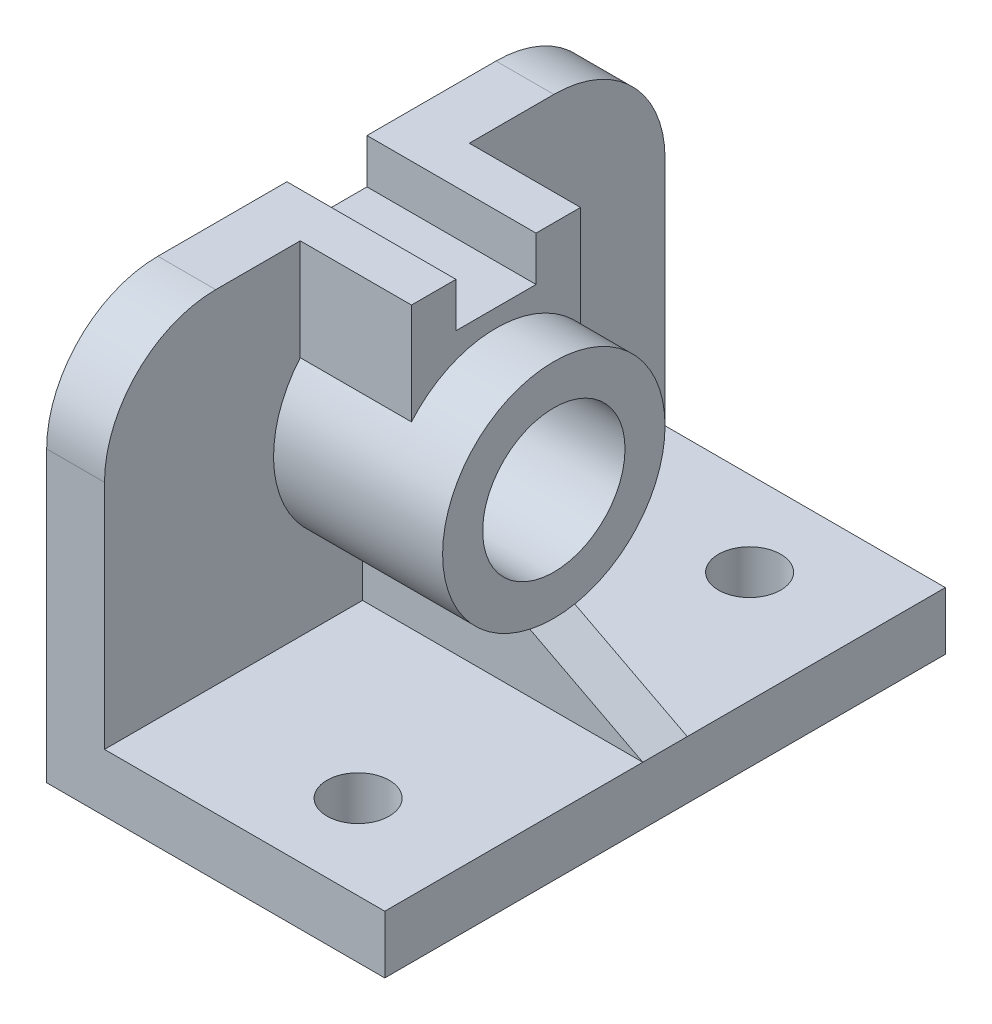
ISO-10303-21;
HEADER;
FILE_DESCRIPTION(('STEP AP214'),'2;1');
FILE_NAME('part.step','',(''),(''),'','','');
FILE_SCHEMA(('AUTOMOTIVE_DESIGN { 1 0 10303 214 1 1 1 1 }'));
ENDSEC;
DATA;
#1=APPLICATION_CONTEXT('core data for automotive mechanical design processes');
#2=APPLICATION_PROTOCOL_DEFINITION('international standard','automotive_design',2000,#1);
#3=PRODUCT_CONTEXT('',#1,'mechanical');
#4=PRODUCT('Part','Part','',(#3));
#5=PRODUCT_RELATED_PRODUCT_CATEGORY('part','',(#4));
#6=PRODUCT_DEFINITION_FORMATION('','',#4);
#7=PRODUCT_DEFINITION_CONTEXT('part definition',#1,'design');
#8=PRODUCT_DEFINITION('design','',#6,#7);
#9=PRODUCT_DEFINITION_SHAPE('','',#8);
#10=(LENGTH_UNIT() NAMED_UNIT(*) SI_UNIT(.MILLI.,.METRE.));
#11=(NAMED_UNIT(*) PLANE_ANGLE_UNIT() SI_UNIT($,.RADIAN.));
#12=(NAMED_UNIT(*) SI_UNIT($,.STERADIAN.) SOLID_ANGLE_UNIT());
#13=UNCERTAINTY_MEASURE_WITH_UNIT(LENGTH_MEASURE(1.E-05),#10,'distance_accuracy_value','');
#14=(GEOMETRIC_REPRESENTATION_CONTEXT(3) GLOBAL_UNCERTAINTY_ASSIGNED_CONTEXT((#13)) GLOBAL_UNIT_ASSIGNED_CONTEXT((#10,
#11,#12)) REPRESENTATION_CONTEXT('',''));
#15=CARTESIAN_POINT('',(0.,0.,0.));
#16=DIRECTION('',(0.,0.,1.));
#17=DIRECTION('',(1.,0.,0.));
#18=AXIS2_PLACEMENT_3D('',#15,#16,#17);
#19=CARTESIAN_POINT('',(-25.,90.,63.));
#20=DIRECTION('',(-1.,0.,0.));
#21=DIRECTION('',(0.,0.,1.));
#22=AXIS2_PLACEMENT_3D('',#19,#20,#21);
#23=PLANE('',#22);
#24=DIRECTION('',(0.,1.,0.));
#25=VECTOR('',#24,1.);
#26=CARTESIAN_POINT('',(-25.,90.,-5.));
#27=LINE('',#26,#25);
#28=CARTESIAN_POINT('',(-25.,13.,-5.));
#29=VERTEX_POINT('',#28);
#30=CARTESIAN_POINT('',(-25.,26.5051025721682,-5.));
#31=VERTEX_POINT('',#30);
#32=EDGE_CURVE('E208',#29,#31,#27,.T.);
#33=ORIENTED_EDGE('',*,*,#32,.F.);
#34=DIRECTION('',(0.,0.,-1.));
#35=VECTOR('',#34,1.);
#36=CARTESIAN_POINT('',(-25.,13.,63.));
#37=LINE('',#36,#35);
#38=CARTESIAN_POINT('',(-25.,13.,-63.));
#39=VERTEX_POINT('',#38);
#40=EDGE_CURVE('E315',#29,#39,#37,.T.);
#41=ORIENTED_EDGE('',*,*,#40,.T.);
#42=DIRECTION('',(0.,-1.,0.));
#43=VECTOR('',#42,1.);
#44=CARTESIAN_POINT('',(-25.,90.,-63.));
#45=LINE('',#44,#43);
#46=CARTESIAN_POINT('',(-25.,65.,-63.));
#47=VERTEX_POINT('',#46);
#48=EDGE_CURVE('E334',#47,#39,#45,.T.);
#49=ORIENTED_EDGE('',*,*,#48,.F.);
#50=CARTESIAN_POINT('',(-25.,65.,-38.));
#51=DIRECTION('',(-1.,0.,0.));
#52=DIRECTION('',(0.,0.,1.));
#53=AXIS2_PLACEMENT_3D('',#50,#51,#52);
#54=CIRCLE('',#53,25.);
#55=CARTESIAN_POINT('',(-25.,90.,-38.));
#56=VERTEX_POINT('',#55);
#57=EDGE_CURVE('E55',#47,#56,#54,.F.);
#58=ORIENTED_EDGE('',*,*,#57,.T.);
#59=DIRECTION('',(0.,0.,-1.));
#60=VECTOR('',#59,1.);
#61=CARTESIAN_POINT('',(-25.,90.,63.));
#62=LINE('',#61,#60);
#63=CARTESIAN_POINT('',(-25.,90.,-19.));
#64=VERTEX_POINT('',#63);
#65=EDGE_CURVE('E329',#64,#56,#62,.T.);
#66=ORIENTED_EDGE('',*,*,#65,.F.);
#67=DIRECTION('',(0.,1.,0.));
#68=VECTOR('',#67,1.);
#69=CARTESIAN_POINT('',(-25.,0.,-19.));
#70=LINE('',#69,#68);
#71=CARTESIAN_POINT('',(-25.,67.2480768092719,-19.));
#72=VERTEX_POINT('',#71);
#73=EDGE_CURVE('E248',#72,#64,#70,.T.);
#74=ORIENTED_EDGE('',*,*,#73,.F.);
#75=CARTESIAN_POINT('',(-25.,51.,0.));
#76=DIRECTION('',(1.,0.,0.));
#77=DIRECTION('',(0.,0.,-1.));
#78=AXIS2_PLACEMENT_3D('',#75,#76,#77);
#79=CIRCLE('',#78,25.);
#80=EDGE_CURVE('E240',#31,#72,#79,.T.);
#81=ORIENTED_EDGE('',*,*,#80,.F.);
#82=EDGE_LOOP('',(#33,#41,#49,#58,#66,#74,#81));
#83=FACE_BOUND('',#82,.T.);
#84=ADVANCED_FACE('F46',(#83),#23,.F.);
#85=CARTESIAN_POINT('',(0.,13.,0.));
#86=DIRECTION('',(0.,1.,0.));
#87=DIRECTION('',(0.,0.,1.));
#88=AXIS2_PLACEMENT_3D('',#85,#86,#87);
#89=PLANE('',#88);
#90=CARTESIAN_POINT('',(13.,13.,-44.));
#91=DIRECTION('',(0.,1.,0.));
#92=DIRECTION('',(0.,0.,-1.));
#93=AXIS2_PLACEMENT_3D('',#90,#91,#92);
#94=CIRCLE('',#93,7.);
#95=CARTESIAN_POINT('',(13.,13.,-37.));
#96=VERTEX_POINT('',#95);
#97=EDGE_CURVE('E549',#96,#96,#94,.T.);
#98=ORIENTED_EDGE('',*,*,#97,.F.);
#99=EDGE_LOOP('',(#98));
#100=FACE_BOUND('',#99,.T.);
#101=ORIENTED_EDGE('',*,*,#40,.F.);
#102=DIRECTION('',(1.,0.,0.));
#103=VECTOR('',#102,1.);
#104=CARTESIAN_POINT('',(0.,13.,-5.));
#105=LINE('',#104,#103);
#106=CARTESIAN_POINT('',(38.,13.,-5.));
#107=VERTEX_POINT('',#106);
#108=EDGE_CURVE('E62',#29,#107,#105,.T.);
#109=ORIENTED_EDGE('',*,*,#108,.T.);
#110=DIRECTION('',(0.,0.,-1.));
#111=VECTOR('',#110,1.);
#112=CARTESIAN_POINT('',(38.,13.,63.));
#113=LINE('',#112,#111);
#114=CARTESIAN_POINT('',(38.,13.,-63.));
#115=VERTEX_POINT('',#114);
#116=EDGE_CURVE('E350',#107,#115,#113,.T.);
#117=ORIENTED_EDGE('',*,*,#116,.T.);
#118=DIRECTION('',(-1.,0.,0.));
#119=VECTOR('',#118,1.);
#120=CARTESIAN_POINT('',(38.,13.,-63.));
#121=LINE('',#120,#119);
#122=EDGE_CURVE('E349',#115,#39,#121,.T.);
#123=ORIENTED_EDGE('',*,*,#122,.T.);
#124=EDGE_LOOP('',(#101,#109,#117,#123));
#125=FACE_BOUND('',#124,.T.);
#126=ADVANCED_FACE('F467',(#100,#125),#89,.T.);
#127=CARTESIAN_POINT('',(-25.,13.,63.));
#128=VERTEX_POINT('',#127);
#129=CARTESIAN_POINT('',(-25.,13.,5.));
#130=VERTEX_POINT('',#129);
#131=EDGE_CURVE('E335',#128,#130,#37,.T.);
#132=ORIENTED_EDGE('',*,*,#131,.T.);
#133=DIRECTION('',(0.,1.,0.));
#134=VECTOR('',#133,1.);
#135=CARTESIAN_POINT('',(-25.,90.,5.));
#136=LINE('',#135,#134);
#137=CARTESIAN_POINT('',(-25.,26.5051025721682,5.));
#138=VERTEX_POINT('',#137);
#139=EDGE_CURVE('E232',#130,#138,#136,.T.);
#140=ORIENTED_EDGE('',*,*,#139,.T.);
#141=CARTESIAN_POINT('',(-25.,67.2480768092719,19.));
#142=VERTEX_POINT('',#141);
#143=EDGE_CURVE('E245',#142,#138,#79,.T.);
#144=ORIENTED_EDGE('',*,*,#143,.F.);
#145=DIRECTION('',(0.,-1.,0.));
#146=VECTOR('',#145,1.);
#147=CARTESIAN_POINT('',(-25.,0.,19.));
#148=LINE('',#147,#146);
#149=CARTESIAN_POINT('',(-25.,90.,19.));
#150=VERTEX_POINT('',#149);
#151=EDGE_CURVE('E256',#150,#142,#148,.T.);
#152=ORIENTED_EDGE('',*,*,#151,.F.);
#153=CARTESIAN_POINT('',(-25.,90.,38.));
#154=VERTEX_POINT('',#153);
#155=EDGE_CURVE('E324',#154,#150,#62,.T.);
#156=ORIENTED_EDGE('',*,*,#155,.F.);
#157=CARTESIAN_POINT('',(-25.,65.,38.));
#158=DIRECTION('',(-1.,0.,0.));
#159=DIRECTION('',(0.,0.,1.));
#160=AXIS2_PLACEMENT_3D('',#157,#158,#159);
#161=CIRCLE('',#160,25.);
#162=CARTESIAN_POINT('',(-25.,65.,63.));
#163=VERTEX_POINT('',#162);
#164=EDGE_CURVE('E403',#154,#163,#161,.F.);
#165=ORIENTED_EDGE('',*,*,#164,.T.);
#166=DIRECTION('',(0.,-1.,0.));
#167=VECTOR('',#166,1.);
#168=CARTESIAN_POINT('',(-25.,90.,63.));
#169=LINE('',#168,#167);
#170=EDGE_CURVE('E342',#163,#128,#169,.T.);
#171=ORIENTED_EDGE('',*,*,#170,.T.);
#172=EDGE_LOOP('',(#132,#140,#144,#152,#156,#165,#171));
#173=FACE_BOUND('',#172,.T.);
#174=ADVANCED_FACE('F469',(#173),#23,.F.);
#175=CARTESIAN_POINT('',(-38.,13.,63.));
#176=DIRECTION('',(-1.,0.,0.));
#177=DIRECTION('',(0.,0.,1.));
#178=AXIS2_PLACEMENT_3D('',#175,#176,#177);
#179=PLANE('',#178);
#180=CARTESIAN_POINT('',(-38.,51.,0.));
#181=DIRECTION('',(1.,0.,0.));
#182=DIRECTION('',(0.,0.,-1.));
#183=AXIS2_PLACEMENT_3D('',#180,#181,#182);
#184=CIRCLE('',#183,16.);
#185=CARTESIAN_POINT('',(-38.,51.,-16.));
#186=VERTEX_POINT('',#185);
#187=EDGE_CURVE('E558',#186,#186,#184,.T.);
#188=ORIENTED_EDGE('',*,*,#187,.T.);
#189=EDGE_LOOP('',(#188));
#190=FACE_BOUND('',#189,.T.);
#191=DIRECTION('',(0.,-1.,0.));
#192=VECTOR('',#191,1.);
#193=CARTESIAN_POINT('',(-38.,13.,-63.));
#194=LINE('',#193,#192);
#195=CARTESIAN_POINT('',(-38.,65.,-63.));
#196=VERTEX_POINT('',#195);
#197=CARTESIAN_POINT('',(-38.,0.,-63.));
#198=VERTEX_POINT('',#197);
#199=EDGE_CURVE('E377',#196,#198,#194,.T.);
#200=ORIENTED_EDGE('',*,*,#199,.T.);
#201=DIRECTION('',(0.,0.,-1.));
#202=VECTOR('',#201,1.);
#203=CARTESIAN_POINT('',(-38.,0.,63.));
#204=LINE('',#203,#202);
#205=CARTESIAN_POINT('',(-38.,0.,63.));
#206=VERTEX_POINT('',#205);
#207=EDGE_CURVE('E365',#206,#198,#204,.T.);
#208=ORIENTED_EDGE('',*,*,#207,.F.);
#209=DIRECTION('',(0.,-1.,0.));
#210=VECTOR('',#209,1.);
#211=CARTESIAN_POINT('',(-38.,13.,63.));
#212=LINE('',#211,#210);
#213=CARTESIAN_POINT('',(-38.,65.,63.));
#214=VERTEX_POINT('',#213);
#215=EDGE_CURVE('E374',#214,#206,#212,.T.);
#216=ORIENTED_EDGE('',*,*,#215,.F.);
#217=CARTESIAN_POINT('',(-38.,65.,38.));
#218=DIRECTION('',(-1.,0.,0.));
#219=DIRECTION('',(0.,0.,1.));
#220=AXIS2_PLACEMENT_3D('',#217,#218,#219);
#221=CIRCLE('',#220,25.);
#222=CARTESIAN_POINT('',(-38.,90.,38.));
#223=VERTEX_POINT('',#222);
#224=EDGE_CURVE('E393',#214,#223,#221,.T.);
#225=ORIENTED_EDGE('',*,*,#224,.T.);
#226=DIRECTION('',(0.,0.,1.));
#227=VECTOR('',#226,1.);
#228=CARTESIAN_POINT('',(-38.,90.,63.));
#229=LINE('',#228,#227);
#230=CARTESIAN_POINT('',(-38.,90.,9.));
#231=VERTEX_POINT('',#230);
#232=EDGE_CURVE('E328',#231,#223,#229,.T.);
#233=ORIENTED_EDGE('',*,*,#232,.F.);
#234=DIRECTION('',(0.,-1.,0.));
#235=VECTOR('',#234,1.);
#236=CARTESIAN_POINT('',(-38.,0.,9.00000000000002));
#237=LINE('',#236,#235);
#238=CARTESIAN_POINT('',(-38.,80.,9.));
#239=VERTEX_POINT('',#238);
#240=EDGE_CURVE('E303',#231,#239,#237,.T.);
#241=ORIENTED_EDGE('',*,*,#240,.T.);
#242=DIRECTION('',(0.,0.,-1.));
#243=VECTOR('',#242,1.);
#244=CARTESIAN_POINT('',(-38.,80.,0.));
#245=LINE('',#244,#243);
#246=CARTESIAN_POINT('',(-38.,80.,-9.));
#247=VERTEX_POINT('',#246);
#248=EDGE_CURVE('E307',#239,#247,#245,.T.);
#249=ORIENTED_EDGE('',*,*,#248,.T.);
#250=DIRECTION('',(0.,-1.,0.));
#251=VECTOR('',#250,1.);
#252=CARTESIAN_POINT('',(-38.,0.,-9.00000000000002));
#253=LINE('',#252,#251);
#254=CARTESIAN_POINT('',(-38.,90.,-9.));
#255=VERTEX_POINT('',#254);
#256=EDGE_CURVE('E300',#255,#247,#253,.T.);
#257=ORIENTED_EDGE('',*,*,#256,.F.);
#258=CARTESIAN_POINT('',(-38.,90.,-38.));
#259=VERTEX_POINT('',#258);
#260=EDGE_CURVE('E330',#259,#255,#229,.T.);
#261=ORIENTED_EDGE('',*,*,#260,.F.);
#262=CARTESIAN_POINT('',(-38.,65.,-38.));
#263=DIRECTION('',(-1.,0.,0.));
#264=DIRECTION('',(0.,0.,1.));
#265=AXIS2_PLACEMENT_3D('',#262,#263,#264);
#266=CIRCLE('',#265,25.);
#267=EDGE_CURVE('E397',#259,#196,#266,.T.);
#268=ORIENTED_EDGE('',*,*,#267,.T.);
#269=EDGE_LOOP('',(#200,#208,#216,#225,#233,#241,#249,#257,#261,#268));
#270=FACE_BOUND('',#269,.T.);
#271=ADVANCED_FACE('F421',(#190,#270),#179,.T.);
#272=CARTESIAN_POINT('',(0.,90.,0.));
#273=DIRECTION('',(0.,1.,0.));
#274=DIRECTION('',(0.,0.,1.));
#275=AXIS2_PLACEMENT_3D('',#272,#273,#274);
#276=PLANE('',#275);
#277=ORIENTED_EDGE('',*,*,#260,.T.);
#278=DIRECTION('',(1.,0.,0.));
#279=VECTOR('',#278,1.);
#280=CARTESIAN_POINT('',(-38.,90.,-9.));
#281=LINE('',#280,#279);
#282=CARTESIAN_POINT('',(0.,90.,-9.));
#283=VERTEX_POINT('',#282);
#284=EDGE_CURVE('E311',#255,#283,#281,.T.);
#285=ORIENTED_EDGE('',*,*,#284,.T.);
#286=DIRECTION('',(0.,0.,1.));
#287=VECTOR('',#286,1.);
#288=CARTESIAN_POINT('',(0.,90.,0.));
#289=LINE('',#288,#287);
#290=CARTESIAN_POINT('',(0.,90.,-19.));
#291=VERTEX_POINT('',#290);
#292=EDGE_CURVE('E259',#291,#283,#289,.T.);
#293=ORIENTED_EDGE('',*,*,#292,.F.);
#294=DIRECTION('',(-1.,0.,0.));
#295=VECTOR('',#294,1.);
#296=CARTESIAN_POINT('',(0.,90.,-19.));
#297=LINE('',#296,#295);
#298=EDGE_CURVE('E292',#291,#64,#297,.T.);
#299=ORIENTED_EDGE('',*,*,#298,.T.);
#300=ORIENTED_EDGE('',*,*,#65,.T.);
#301=DIRECTION('',(-1.,0.,0.));
#302=VECTOR('',#301,1.);
#303=CARTESIAN_POINT('',(-38.,90.,-38.));
#304=LINE('',#303,#302);
#305=EDGE_CURVE('E389',#56,#259,#304,.T.);
#306=ORIENTED_EDGE('',*,*,#305,.T.);
#307=EDGE_LOOP('',(#277,#285,#293,#299,#300,#306));
#308=FACE_BOUND('',#307,.T.);
#309=ADVANCED_FACE('F418',(#308),#276,.T.);
#310=CARTESIAN_POINT('',(38.,13.,63.));
#311=DIRECTION('',(-1.,0.,0.));
#312=DIRECTION('',(0.,0.,1.));
#313=AXIS2_PLACEMENT_3D('',#310,#311,#312);
#314=PLANE('',#313);
#315=DIRECTION('',(0.,0.,-1.));
#316=VECTOR('',#315,1.);
#317=CARTESIAN_POINT('',(38.,0.,63.));
#318=LINE('',#317,#316);
#319=CARTESIAN_POINT('',(38.,0.,63.));
#320=VERTEX_POINT('',#319);
#321=CARTESIAN_POINT('',(38.,0.,-63.));
#322=VERTEX_POINT('',#321);
#323=EDGE_CURVE('E345',#320,#322,#318,.T.);
#324=ORIENTED_EDGE('',*,*,#323,.T.);
#325=DIRECTION('',(0.,-1.,0.));
#326=VECTOR('',#325,1.);
#327=CARTESIAN_POINT('',(38.,13.,-63.));
#328=LINE('',#327,#326);
#329=EDGE_CURVE('E381',#115,#322,#328,.T.);
#330=ORIENTED_EDGE('',*,*,#329,.F.);
#331=ORIENTED_EDGE('',*,*,#116,.F.);
#332=DIRECTION('',(0.,0.,1.));
#333=VECTOR('',#332,1.);
#334=CARTESIAN_POINT('',(38.,13.,0.));
#335=LINE('',#334,#333);
#336=CARTESIAN_POINT('',(38.,13.,5.));
#337=VERTEX_POINT('',#336);
#338=EDGE_CURVE('E69',#337,#107,#335,.F.);
#339=ORIENTED_EDGE('',*,*,#338,.F.);
#340=CARTESIAN_POINT('',(38.,13.,63.));
#341=VERTEX_POINT('',#340);
#342=EDGE_CURVE('E346',#341,#337,#113,.T.);
#343=ORIENTED_EDGE('',*,*,#342,.F.);
#344=DIRECTION('',(0.,-1.,0.));
#345=VECTOR('',#344,1.);
#346=CARTESIAN_POINT('',(38.,13.,63.));
#347=LINE('',#346,#345);
#348=EDGE_CURVE('E358',#341,#320,#347,.T.);
#349=ORIENTED_EDGE('',*,*,#348,.T.);
#350=EDGE_LOOP('',(#324,#330,#331,#339,#343,#349));
#351=FACE_BOUND('',#350,.T.);
#352=ADVANCED_FACE('F492',(#351),#314,.F.);
#353=CARTESIAN_POINT('',(38.,13.,-63.));
#354=DIRECTION('',(0.,0.,1.));
#355=DIRECTION('',(1.,0.,0.));
#356=AXIS2_PLACEMENT_3D('',#353,#354,#355);
#357=PLANE('',#356);
#358=ORIENTED_EDGE('',*,*,#199,.F.);
#359=DIRECTION('',(-1.,0.,0.));
#360=VECTOR('',#359,1.);
#361=CARTESIAN_POINT('',(-25.,65.,-63.));
#362=LINE('',#361,#360);
#363=EDGE_CURVE('E400',#196,#47,#362,.F.);
#364=ORIENTED_EDGE('',*,*,#363,.T.);
#365=ORIENTED_EDGE('',*,*,#48,.T.);
#366=ORIENTED_EDGE('',*,*,#122,.F.);
#367=ORIENTED_EDGE('',*,*,#329,.T.);
#368=DIRECTION('',(-1.,0.,0.));
#369=VECTOR('',#368,1.);
#370=CARTESIAN_POINT('',(38.,0.,-63.));
#371=LINE('',#370,#369);
#372=EDGE_CURVE('E361',#322,#198,#371,.T.);
#373=ORIENTED_EDGE('',*,*,#372,.T.);
#374=EDGE_LOOP('',(#358,#364,#365,#366,#367,#373));
#375=FACE_BOUND('',#374,.T.);
#376=ADVANCED_FACE('F506',(#375),#357,.F.);
#377=CARTESIAN_POINT('',(38.,13.,63.));
#378=DIRECTION('',(0.,0.,1.));
#379=DIRECTION('',(1.,0.,0.));
#380=AXIS2_PLACEMENT_3D('',#377,#378,#379);
#381=PLANE('',#380);
#382=ORIENTED_EDGE('',*,*,#170,.F.);
#383=DIRECTION('',(1.,0.,0.));
#384=VECTOR('',#383,1.);
#385=CARTESIAN_POINT('',(38.,65.,63.));
#386=LINE('',#385,#384);
#387=EDGE_CURVE('E11',#163,#214,#386,.F.);
#388=ORIENTED_EDGE('',*,*,#387,.T.);
#389=ORIENTED_EDGE('',*,*,#215,.T.);
#390=DIRECTION('',(-1.,0.,0.));
#391=VECTOR('',#390,1.);
#392=CARTESIAN_POINT('',(38.,0.,63.));
#393=LINE('',#392,#391);
#394=EDGE_CURVE('E368',#320,#206,#393,.T.);
#395=ORIENTED_EDGE('',*,*,#394,.F.);
#396=ORIENTED_EDGE('',*,*,#348,.F.);
#397=DIRECTION('',(-1.,0.,0.));
#398=VECTOR('',#397,1.);
#399=CARTESIAN_POINT('',(38.,13.,63.));
#400=LINE('',#399,#398);
#401=EDGE_CURVE('E354',#341,#128,#400,.T.);
#402=ORIENTED_EDGE('',*,*,#401,.T.);
#403=EDGE_LOOP('',(#382,#388,#389,#395,#396,#402));
#404=FACE_BOUND('',#403,.T.);
#405=ADVANCED_FACE('F500',(#404),#381,.T.);
#406=CARTESIAN_POINT('',(13.,13.,44.));
#407=DIRECTION('',(0.,1.,0.));
#408=DIRECTION('',(0.,0.,1.));
#409=AXIS2_PLACEMENT_3D('',#406,#407,#408);
#410=CIRCLE('',#409,7.);
#411=CARTESIAN_POINT('',(13.,13.,51.));
#412=VERTEX_POINT('',#411);
#413=EDGE_CURVE('E221',#412,#412,#410,.T.);
#414=ORIENTED_EDGE('',*,*,#413,.F.);
#415=EDGE_LOOP('',(#414));
#416=FACE_BOUND('',#415,.T.);
#417=DIRECTION('',(1.,0.,0.));
#418=VECTOR('',#417,1.);
#419=CARTESIAN_POINT('',(0.,13.,5.));
#420=LINE('',#419,#418);
#421=EDGE_CURVE('E201',#130,#337,#420,.T.);
#422=ORIENTED_EDGE('',*,*,#421,.F.);
#423=ORIENTED_EDGE('',*,*,#131,.F.);
#424=ORIENTED_EDGE('',*,*,#401,.F.);
#425=ORIENTED_EDGE('',*,*,#342,.T.);
#426=EDGE_LOOP('',(#422,#423,#424,#425));
#427=FACE_BOUND('',#426,.T.);
#428=ADVANCED_FACE('F477',(#416,#427),#89,.T.);
#429=CARTESIAN_POINT('',(0.,0.,0.));
#430=DIRECTION('',(0.,1.,0.));
#431=DIRECTION('',(0.,0.,1.));
#432=AXIS2_PLACEMENT_3D('',#429,#430,#431);
#433=PLANE('',#432);
#434=CARTESIAN_POINT('',(13.,0.,44.));
#435=DIRECTION('',(0.,1.,0.));
#436=DIRECTION('',(0.,0.,1.));
#437=AXIS2_PLACEMENT_3D('',#434,#435,#436);
#438=CIRCLE('',#437,7.);
#439=CARTESIAN_POINT('',(13.,0.,51.));
#440=VERTEX_POINT('',#439);
#441=EDGE_CURVE('E215',#440,#440,#438,.T.);
#442=ORIENTED_EDGE('',*,*,#441,.T.);
#443=EDGE_LOOP('',(#442));
#444=FACE_BOUND('',#443,.T.);
#445=CARTESIAN_POINT('',(13.,0.,-44.));
#446=DIRECTION('',(0.,1.,0.));
#447=DIRECTION('',(0.,0.,-1.));
#448=AXIS2_PLACEMENT_3D('',#445,#446,#447);
#449=CIRCLE('',#448,7.);
#450=CARTESIAN_POINT('',(13.,0.,-37.));
#451=VERTEX_POINT('',#450);
#452=EDGE_CURVE('E553',#451,#451,#449,.T.);
#453=ORIENTED_EDGE('',*,*,#452,.T.);
#454=EDGE_LOOP('',(#453));
#455=FACE_BOUND('',#454,.T.);
#456=ORIENTED_EDGE('',*,*,#207,.T.);
#457=ORIENTED_EDGE('',*,*,#372,.F.);
#458=ORIENTED_EDGE('',*,*,#323,.F.);
#459=ORIENTED_EDGE('',*,*,#394,.T.);
#460=EDGE_LOOP('',(#456,#457,#458,#459));
#461=FACE_BOUND('',#460,.T.);
#462=ADVANCED_FACE('F499',(#444,#455,#461),#433,.F.);
#463=DIRECTION('',(1.,0.,0.));
#464=VECTOR('',#463,1.);
#465=CARTESIAN_POINT('',(-38.,90.,9.));
#466=LINE('',#465,#464);
#467=CARTESIAN_POINT('',(0.,90.,9.));
#468=VERTEX_POINT('',#467);
#469=EDGE_CURVE('E319',#231,#468,#466,.T.);
#470=ORIENTED_EDGE('',*,*,#469,.F.);
#471=ORIENTED_EDGE('',*,*,#232,.T.);
#472=DIRECTION('',(1.,0.,0.));
#473=VECTOR('',#472,1.);
#474=CARTESIAN_POINT('',(0.,90.,38.));
#475=LINE('',#474,#473);
#476=EDGE_CURVE('E385',#223,#154,#475,.T.);
#477=ORIENTED_EDGE('',*,*,#476,.T.);
#478=ORIENTED_EDGE('',*,*,#155,.T.);
#479=DIRECTION('',(-1.,0.,0.));
#480=VECTOR('',#479,1.);
#481=CARTESIAN_POINT('',(0.,90.,19.));
#482=LINE('',#481,#480);
#483=CARTESIAN_POINT('',(0.,90.,19.));
#484=VERTEX_POINT('',#483);
#485=EDGE_CURVE('E289',#484,#150,#482,.T.);
#486=ORIENTED_EDGE('',*,*,#485,.F.);
#487=EDGE_CURVE('E264',#468,#484,#289,.T.);
#488=ORIENTED_EDGE('',*,*,#487,.F.);
#489=EDGE_LOOP('',(#470,#471,#477,#478,#486,#488));
#490=FACE_BOUND('',#489,.T.);
#491=ADVANCED_FACE('F442',(#490),#276,.T.);
#492=CARTESIAN_POINT('',(0.,65.,-38.));
#493=DIRECTION('',(1.,0.,0.));
#494=DIRECTION('',(0.,0.,-1.));
#495=AXIS2_PLACEMENT_3D('',#492,#493,#494);
#496=CYLINDRICAL_SURFACE('',#495,25.);
#497=ORIENTED_EDGE('',*,*,#57,.F.);
#498=ORIENTED_EDGE('',*,*,#363,.F.);
#499=ORIENTED_EDGE('',*,*,#267,.F.);
#500=ORIENTED_EDGE('',*,*,#305,.F.);
#501=EDGE_LOOP('',(#497,#498,#499,#500));
#502=FACE_BOUND('',#501,.T.);
#503=ADVANCED_FACE('F415',(#502),#496,.T.);
#504=CARTESIAN_POINT('',(0.,65.,38.));
#505=DIRECTION('',(1.,0.,0.));
#506=DIRECTION('',(0.,0.,-1.));
#507=AXIS2_PLACEMENT_3D('',#504,#505,#506);
#508=CYLINDRICAL_SURFACE('',#507,25.);
#509=ORIENTED_EDGE('',*,*,#224,.F.);
#510=ORIENTED_EDGE('',*,*,#387,.F.);
#511=ORIENTED_EDGE('',*,*,#164,.F.);
#512=ORIENTED_EDGE('',*,*,#476,.F.);
#513=EDGE_LOOP('',(#509,#510,#511,#512));
#514=FACE_BOUND('',#513,.T.);
#515=ADVANCED_FACE('F48',(#514),#508,.T.);
#516=CARTESIAN_POINT('',(-38.,0.,-9.00000000000002));
#517=DIRECTION('',(0.,0.,1.));
#518=DIRECTION('',(0.,-1.,0.));
#519=AXIS2_PLACEMENT_3D('',#516,#517,#518);
#520=PLANE('',#519);
#521=DIRECTION('',(1.,0.,0.));
#522=VECTOR('',#521,1.);
#523=CARTESIAN_POINT('',(-38.,80.,-9.));
#524=LINE('',#523,#522);
#525=CARTESIAN_POINT('',(0.,80.,-9.));
#526=VERTEX_POINT('',#525);
#527=EDGE_CURVE('E312',#247,#526,#524,.T.);
#528=ORIENTED_EDGE('',*,*,#527,.T.);
#529=DIRECTION('',(0.,-1.,0.));
#530=VECTOR('',#529,1.);
#531=CARTESIAN_POINT('',(0.,0.,-9.00000000000001));
#532=LINE('',#531,#530);
#533=EDGE_CURVE('E263',#283,#526,#532,.T.);
#534=ORIENTED_EDGE('',*,*,#533,.F.);
#535=ORIENTED_EDGE('',*,*,#284,.F.);
#536=ORIENTED_EDGE('',*,*,#256,.T.);
#537=EDGE_LOOP('',(#528,#534,#535,#536));
#538=FACE_BOUND('',#537,.T.);
#539=ADVANCED_FACE('F426',(#538),#520,.T.);
#540=CARTESIAN_POINT('',(-38.,80.,0.));
#541=DIRECTION('',(0.,-1.,0.));
#542=DIRECTION('',(0.,0.,-1.));
#543=AXIS2_PLACEMENT_3D('',#540,#541,#542);
#544=PLANE('',#543);
#545=DIRECTION('',(1.,0.,0.));
#546=VECTOR('',#545,1.);
#547=CARTESIAN_POINT('',(-38.,80.,9.));
#548=LINE('',#547,#546);
#549=CARTESIAN_POINT('',(0.,80.,9.00000000000001));
#550=VERTEX_POINT('',#549);
#551=EDGE_CURVE('E316',#239,#550,#548,.T.);
#552=ORIENTED_EDGE('',*,*,#551,.T.);
#553=DIRECTION('',(0.,0.,-1.));
#554=VECTOR('',#553,1.);
#555=CARTESIAN_POINT('',(0.,80.,0.));
#556=LINE('',#555,#554);
#557=EDGE_CURVE('E268',#550,#526,#556,.T.);
#558=ORIENTED_EDGE('',*,*,#557,.T.);
#559=ORIENTED_EDGE('',*,*,#527,.F.);
#560=ORIENTED_EDGE('',*,*,#248,.F.);
#561=EDGE_LOOP('',(#552,#558,#559,#560));
#562=FACE_BOUND('',#561,.T.);
#563=ADVANCED_FACE('F429',(#562),#544,.F.);
#564=CARTESIAN_POINT('',(-38.,0.,9.00000000000002));
#565=DIRECTION('',(0.,0.,1.));
#566=DIRECTION('',(0.,-1.,0.));
#567=AXIS2_PLACEMENT_3D('',#564,#565,#566);
#568=PLANE('',#567);
#569=ORIENTED_EDGE('',*,*,#469,.T.);
#570=DIRECTION('',(0.,-1.,0.));
#571=VECTOR('',#570,1.);
#572=CARTESIAN_POINT('',(0.,0.,9.00000000000002));
#573=LINE('',#572,#571);
#574=EDGE_CURVE('E272',#468,#550,#573,.T.);
#575=ORIENTED_EDGE('',*,*,#574,.T.);
#576=ORIENTED_EDGE('',*,*,#551,.F.);
#577=ORIENTED_EDGE('',*,*,#240,.F.);
#578=EDGE_LOOP('',(#569,#575,#576,#577));
#579=FACE_BOUND('',#578,.T.);
#580=ADVANCED_FACE('F436',(#579),#568,.F.);
#581=CARTESIAN_POINT('',(0.,0.,-19.));
#582=DIRECTION('',(0.,0.,1.));
#583=DIRECTION('',(1.,0.,0.));
#584=AXIS2_PLACEMENT_3D('',#581,#582,#583);
#585=PLANE('',#584);
#586=ORIENTED_EDGE('',*,*,#73,.T.);
#587=ORIENTED_EDGE('',*,*,#298,.F.);
#588=DIRECTION('',(0.,1.,0.));
#589=VECTOR('',#588,1.);
#590=CARTESIAN_POINT('',(0.,0.,-19.));
#591=LINE('',#590,#589);
#592=CARTESIAN_POINT('',(0.,67.2480768092719,-19.));
#593=VERTEX_POINT('',#592);
#594=EDGE_CURVE('E255',#593,#291,#591,.T.);
#595=ORIENTED_EDGE('',*,*,#594,.F.);
#596=DIRECTION('',(-1.,0.,0.));
#597=VECTOR('',#596,1.);
#598=CARTESIAN_POINT('',(0.,67.2480768092719,-19.));
#599=LINE('',#598,#597);
#600=EDGE_CURVE('E296',#593,#72,#599,.T.);
#601=ORIENTED_EDGE('',*,*,#600,.T.);
#602=EDGE_LOOP('',(#586,#587,#595,#601));
#603=FACE_BOUND('',#602,.T.);
#604=ADVANCED_FACE('F514',(#603),#585,.F.);
#605=CARTESIAN_POINT('',(0.,0.,19.));
#606=DIRECTION('',(0.,0.,-1.));
#607=DIRECTION('',(-1.,0.,0.));
#608=AXIS2_PLACEMENT_3D('',#605,#606,#607);
#609=PLANE('',#608);
#610=ORIENTED_EDGE('',*,*,#151,.T.);
#611=DIRECTION('',(-1.,0.,0.));
#612=VECTOR('',#611,1.);
#613=CARTESIAN_POINT('',(0.,67.2480768092719,19.));
#614=LINE('',#613,#612);
#615=CARTESIAN_POINT('',(0.,67.2480768092719,19.));
#616=VERTEX_POINT('',#615);
#617=EDGE_CURVE('E280',#616,#142,#614,.T.);
#618=ORIENTED_EDGE('',*,*,#617,.F.);
#619=DIRECTION('',(0.,-1.,0.));
#620=VECTOR('',#619,1.);
#621=CARTESIAN_POINT('',(0.,0.,19.));
#622=LINE('',#621,#620);
#623=EDGE_CURVE('E276',#484,#616,#622,.T.);
#624=ORIENTED_EDGE('',*,*,#623,.F.);
#625=ORIENTED_EDGE('',*,*,#485,.T.);
#626=EDGE_LOOP('',(#610,#618,#624,#625));
#627=FACE_BOUND('',#626,.T.);
#628=ADVANCED_FACE('F518',(#627),#609,.F.);
#629=CARTESIAN_POINT('',(0.,0.,0.));
#630=DIRECTION('',(1.,0.,0.));
#631=DIRECTION('',(0.,0.,-1.));
#632=AXIS2_PLACEMENT_3D('',#629,#630,#631);
#633=PLANE('',#632);
#634=CARTESIAN_POINT('',(0.,51.,0.));
#635=DIRECTION('',(1.,0.,0.));
#636=DIRECTION('',(0.,0.,-1.));
#637=AXIS2_PLACEMENT_3D('',#634,#635,#636);
#638=CIRCLE('',#637,25.);
#639=EDGE_CURVE('E251',#593,#616,#638,.T.);
#640=ORIENTED_EDGE('',*,*,#639,.F.);
#641=ORIENTED_EDGE('',*,*,#594,.T.);
#642=ORIENTED_EDGE('',*,*,#292,.T.);
#643=ORIENTED_EDGE('',*,*,#533,.T.);
#644=ORIENTED_EDGE('',*,*,#557,.F.);
#645=ORIENTED_EDGE('',*,*,#574,.F.);
#646=ORIENTED_EDGE('',*,*,#487,.T.);
#647=ORIENTED_EDGE('',*,*,#623,.T.);
#648=EDGE_LOOP('',(#640,#641,#642,#643,#644,#645,#646,#647));
#649=FACE_BOUND('',#648,.T.);
#650=ADVANCED_FACE('F434',(#649),#633,.T.);
#651=CARTESIAN_POINT('',(13.,51.,0.));
#652=DIRECTION('',(-1.,0.,0.));
#653=DIRECTION('',(0.,0.,1.));
#654=AXIS2_PLACEMENT_3D('',#651,#652,#653);
#655=CYLINDRICAL_SURFACE('',#654,25.);
#656=ORIENTED_EDGE('',*,*,#143,.T.);
#657=DIRECTION('',(-1.,0.,0.));
#658=VECTOR('',#657,1.);
#659=CARTESIAN_POINT('',(13.,26.5051025721682,5.));
#660=LINE('',#659,#658);
#661=CARTESIAN_POINT('',(12.0286488996765,26.5051025721682,5.));
#662=VERTEX_POINT('',#661);
#663=EDGE_CURVE('E229',#138,#662,#660,.F.);
#664=ORIENTED_EDGE('',*,*,#663,.T.);
#665=CARTESIAN_POINT('',(-35.0769230769231,51.,0.));
#666=DIRECTION('',(-0.461352736641989,-0.887216801234595,0.));
#667=DIRECTION('',(-0.887216801234595,0.461352736641989,0.));
#668=AXIS2_PLACEMENT_3D('',#665,#666,#667);
#669=ELLIPSE('',#668,54.1884723215591,25.);
#670=CARTESIAN_POINT('',(13.,26.,0.));
#671=VERTEX_POINT('',#670);
#672=EDGE_CURVE('E200',#662,#671,#669,.F.);
#673=ORIENTED_EDGE('',*,*,#672,.T.);
#674=CARTESIAN_POINT('',(13.,51.,0.));
#675=DIRECTION('',(1.,0.,0.));
#676=DIRECTION('',(0.,0.,-1.));
#677=AXIS2_PLACEMENT_3D('',#674,#675,#676);
#678=CIRCLE('',#677,25.);
#679=EDGE_CURVE('E195',#671,#671,#678,.T.);
#680=ORIENTED_EDGE('',*,*,#679,.F.);
#681=CARTESIAN_POINT('',(12.0286488996765,26.5051025721682,-5.));
#682=VERTEX_POINT('',#681);
#683=EDGE_CURVE('E188',#671,#682,#669,.F.);
#684=ORIENTED_EDGE('',*,*,#683,.T.);
#685=DIRECTION('',(-1.,0.,0.));
#686=VECTOR('',#685,1.);
#687=CARTESIAN_POINT('',(13.,26.5051025721682,-5.));
#688=LINE('',#687,#686);
#689=EDGE_CURVE('E192',#31,#682,#688,.F.);
#690=ORIENTED_EDGE('',*,*,#689,.F.);
#691=ORIENTED_EDGE('',*,*,#80,.T.);
#692=ORIENTED_EDGE('',*,*,#600,.F.);
#693=ORIENTED_EDGE('',*,*,#639,.T.);
#694=ORIENTED_EDGE('',*,*,#617,.T.);
#695=EDGE_LOOP('',(#656,#664,#673,#680,#684,#690,#691,#692,#693,#694));
#696=FACE_BOUND('',#695,.T.);
#697=ADVANCED_FACE('F191',(#696),#655,.T.);
#698=CARTESIAN_POINT('',(13.,51.,0.));
#699=DIRECTION('',(-1.,0.,0.));
#700=DIRECTION('',(0.,0.,1.));
#701=AXIS2_PLACEMENT_3D('',#698,#699,#700);
#702=CYLINDRICAL_SURFACE('',#701,16.);
#703=CARTESIAN_POINT('',(13.,51.,0.));
#704=DIRECTION('',(1.,0.,0.));
#705=DIRECTION('',(0.,0.,-1.));
#706=AXIS2_PLACEMENT_3D('',#703,#704,#705);
#707=CIRCLE('',#706,16.);
#708=CARTESIAN_POINT('',(13.,51.,-16.));
#709=VERTEX_POINT('',#708);
#710=EDGE_CURVE('E241',#709,#709,#707,.T.);
#711=ORIENTED_EDGE('',*,*,#710,.T.);
#712=EDGE_LOOP('',(#711));
#713=FACE_BOUND('',#712,.T.);
#714=ORIENTED_EDGE('',*,*,#187,.F.);
#715=EDGE_LOOP('',(#714));
#716=FACE_BOUND('',#715,.T.);
#717=ADVANCED_FACE('F452',(#713,#716),#702,.F.);
#718=CARTESIAN_POINT('',(13.,0.,0.));
#719=DIRECTION('',(1.,0.,0.));
#720=DIRECTION('',(0.,0.,-1.));
#721=AXIS2_PLACEMENT_3D('',#718,#719,#720);
#722=PLANE('',#721);
#723=ORIENTED_EDGE('',*,*,#710,.F.);
#724=EDGE_LOOP('',(#723));
#725=FACE_BOUND('',#724,.T.);
#726=ORIENTED_EDGE('',*,*,#679,.T.);
#727=EDGE_LOOP('',(#726));
#728=FACE_BOUND('',#727,.T.);
#729=ADVANCED_FACE('F450',(#725,#728),#722,.T.);
#730=CARTESIAN_POINT('',(13.,26.,0.));
#731=DIRECTION('',(-0.461352736641989,-0.887216801234595,0.));
#732=DIRECTION('',(0.887216801234595,-0.461352736641989,0.));
#733=AXIS2_PLACEMENT_3D('',#730,#731,#732);
#734=PLANE('',#733);
#735=DIRECTION('',(0.887216801234595,-0.461352736641989,0.));
#736=VECTOR('',#735,1.);
#737=CARTESIAN_POINT('',(13.,26.,5.));
#738=LINE('',#737,#736);
#739=EDGE_CURVE('E210',#662,#337,#738,.T.);
#740=ORIENTED_EDGE('',*,*,#739,.T.);
#741=ORIENTED_EDGE('',*,*,#338,.T.);
#742=DIRECTION('',(0.887216801234595,-0.461352736641989,0.));
#743=VECTOR('',#742,1.);
#744=CARTESIAN_POINT('',(13.,26.,-5.));
#745=LINE('',#744,#743);
#746=EDGE_CURVE('E207',#682,#107,#745,.T.);
#747=ORIENTED_EDGE('',*,*,#746,.F.);
#748=ORIENTED_EDGE('',*,*,#683,.F.);
#749=ORIENTED_EDGE('',*,*,#672,.F.);
#750=EDGE_LOOP('',(#740,#741,#747,#748,#749));
#751=FACE_BOUND('',#750,.T.);
#752=ADVANCED_FACE('F213',(#751),#734,.F.);
#753=CARTESIAN_POINT('',(0.,45.,5.));
#754=DIRECTION('',(0.,0.,1.));
#755=DIRECTION('',(1.,0.,0.));
#756=AXIS2_PLACEMENT_3D('',#753,#754,#755);
#757=PLANE('',#756);
#758=ORIENTED_EDGE('',*,*,#139,.F.);
#759=ORIENTED_EDGE('',*,*,#421,.T.);
#760=ORIENTED_EDGE('',*,*,#739,.F.);
#761=ORIENTED_EDGE('',*,*,#663,.F.);
#762=EDGE_LOOP('',(#758,#759,#760,#761));
#763=FACE_BOUND('',#762,.T.);
#764=ADVANCED_FACE('F459',(#763),#757,.T.);
#765=CARTESIAN_POINT('',(0.,45.,-5.));
#766=DIRECTION('',(0.,0.,1.));
#767=DIRECTION('',(1.,0.,0.));
#768=AXIS2_PLACEMENT_3D('',#765,#766,#767);
#769=PLANE('',#768);
#770=ORIENTED_EDGE('',*,*,#108,.F.);
#771=ORIENTED_EDGE('',*,*,#32,.T.);
#772=ORIENTED_EDGE('',*,*,#689,.T.);
#773=ORIENTED_EDGE('',*,*,#746,.T.);
#774=EDGE_LOOP('',(#770,#771,#772,#773));
#775=FACE_BOUND('',#774,.T.);
#776=ADVANCED_FACE('F206',(#775),#769,.F.);
#777=CARTESIAN_POINT('',(13.,0.,-44.));
#778=DIRECTION('',(0.,1.,0.));
#779=DIRECTION('',(0.,0.,1.));
#780=AXIS2_PLACEMENT_3D('',#777,#778,#779);
#781=CYLINDRICAL_SURFACE('',#780,7.);
#782=CARTESIAN_POINT('',(13.,0.,-37.));
#783=CARTESIAN_POINT('',(13.,0.135416666666666,-37.));
#784=CARTESIAN_POINT('',(13.,0.270833333333333,-37.));
#785=CARTESIAN_POINT('',(13.,0.541666666666667,-37.));
#786=CARTESIAN_POINT('',(13.,0.677083333333333,-37.));
#787=CARTESIAN_POINT('',(13.,0.947916666666667,-37.));
#788=CARTESIAN_POINT('',(13.,1.08333333333333,-37.));
#789=CARTESIAN_POINT('',(13.,1.35416666666667,-37.));
#790=CARTESIAN_POINT('',(13.,1.48958333333333,-37.));
#791=CARTESIAN_POINT('',(13.,1.76041666666667,-37.));
#792=CARTESIAN_POINT('',(13.,1.89583333333333,-37.));
#793=CARTESIAN_POINT('',(13.,2.16666666666667,-37.));
#794=CARTESIAN_POINT('',(13.,2.30208333333333,-37.));
#795=CARTESIAN_POINT('',(13.,2.57291666666667,-37.));
#796=CARTESIAN_POINT('',(13.,2.70833333333333,-37.));
#797=CARTESIAN_POINT('',(13.,2.97916666666667,-37.));
#798=CARTESIAN_POINT('',(13.,3.11458333333333,-37.));
#799=CARTESIAN_POINT('',(13.,3.38541666666667,-37.));
#800=CARTESIAN_POINT('',(13.,3.52083333333333,-37.));
#801=CARTESIAN_POINT('',(13.,3.79166666666667,-37.));
#802=CARTESIAN_POINT('',(13.,3.92708333333333,-37.));
#803=CARTESIAN_POINT('',(13.,4.19791666666667,-37.));
#804=CARTESIAN_POINT('',(13.,4.33333333333333,-37.));
#805=CARTESIAN_POINT('',(13.,4.60416666666667,-37.));
#806=CARTESIAN_POINT('',(13.,4.73958333333333,-37.));
#807=CARTESIAN_POINT('',(13.,5.01041666666667,-37.));
#808=CARTESIAN_POINT('',(13.,5.14583333333333,-37.));
#809=CARTESIAN_POINT('',(13.,5.41666666666667,-37.));
#810=CARTESIAN_POINT('',(13.,5.55208333333333,-37.));
#811=CARTESIAN_POINT('',(13.,5.82291666666667,-37.));
#812=CARTESIAN_POINT('',(13.,5.95833333333333,-37.));
#813=CARTESIAN_POINT('',(13.,6.22916666666667,-37.));
#814=CARTESIAN_POINT('',(13.,6.36458333333333,-37.));
#815=CARTESIAN_POINT('',(13.,6.63541666666667,-37.));
#816=CARTESIAN_POINT('',(13.,6.77083333333333,-37.));
#817=CARTESIAN_POINT('',(13.,7.04166666666667,-37.));
#818=CARTESIAN_POINT('',(13.,7.17708333333333,-37.));
#819=CARTESIAN_POINT('',(13.,7.44791666666667,-37.));
#820=CARTESIAN_POINT('',(13.,7.58333333333333,-37.));
#821=CARTESIAN_POINT('',(13.,7.85416666666667,-37.));
#822=CARTESIAN_POINT('',(13.,7.98958333333333,-37.));
#823=CARTESIAN_POINT('',(13.,8.26041666666667,-37.));
#824=CARTESIAN_POINT('',(13.,8.39583333333333,-37.));
#825=CARTESIAN_POINT('',(13.,8.66666666666667,-37.));
#826=CARTESIAN_POINT('',(13.,8.80208333333333,-37.));
#827=CARTESIAN_POINT('',(13.,9.07291666666667,-37.));
#828=CARTESIAN_POINT('',(13.,9.20833333333333,-37.));
#829=CARTESIAN_POINT('',(13.,9.47916666666667,-37.));
#830=CARTESIAN_POINT('',(13.,9.61458333333333,-37.));
#831=CARTESIAN_POINT('',(13.,9.88541666666667,-37.));
#832=CARTESIAN_POINT('',(13.,10.0208333333333,-37.));
#833=CARTESIAN_POINT('',(13.,10.2916666666667,-37.));
#834=CARTESIAN_POINT('',(13.,10.4270833333333,-37.));
#835=CARTESIAN_POINT('',(13.,10.6979166666667,-37.));
#836=CARTESIAN_POINT('',(13.,10.8333333333333,-37.));
#837=CARTESIAN_POINT('',(13.,11.1041666666667,-37.));
#838=CARTESIAN_POINT('',(13.,11.2395833333333,-37.));
#839=CARTESIAN_POINT('',(13.,11.5104166666667,-37.));
#840=CARTESIAN_POINT('',(13.,11.6458333333333,-37.));
#841=CARTESIAN_POINT('',(13.,11.9166666666667,-37.));
#842=CARTESIAN_POINT('',(13.,12.0520833333333,-37.));
#843=CARTESIAN_POINT('',(13.,12.3229166666667,-37.));
#844=CARTESIAN_POINT('',(13.,12.4583333333333,-37.));
#845=CARTESIAN_POINT('',(13.,12.7291666666667,-37.));
#846=CARTESIAN_POINT('',(13.,12.8645833333333,-37.));
#847=CARTESIAN_POINT('',(13.,13.,-37.));
#848=B_SPLINE_CURVE_WITH_KNOTS('',3,(#782,#783,#784,#785,#786,#787,#788,#789,#790,#791,#792,
#793,#794,#795,#796,#797,#798,#799,#800,#801,#802,#803,#804,#805,#806,#807,#808,#809,#810,#811,
#812,#813,#814,#815,#816,#817,#818,#819,#820,#821,#822,#823,#824,#825,#826,#827,#828,#829,#830,
#831,#832,#833,#834,#835,#836,#837,#838,#839,#840,#841,#842,#843,#844,#845,#846,#847),
.UNSPECIFIED.,.F.,.F.,(4,2,2,2,2,2,2,2,2,2,2,2,2,2,2,2,2,2,2,2,2,2,2,2,2,2,2,2,2,2,2,2,4),(0.,
0.40625,0.8125,1.21875,1.625,2.03125,2.4375,2.84375,3.25,3.65625,4.0625,4.46875,4.875,5.28125,
5.6875,6.09375,6.5,6.90625,7.3125,7.71875,8.125,8.53125,8.9375,9.34375,9.75,10.15625,10.5625,
10.96875,11.375,11.78125,12.1875,12.59375,13.),.UNSPECIFIED.);
#849=EDGE_CURVE('BSEAM566',#451,#96,#848,.T.);
#850=ORIENTED_EDGE('',*,*,#452,.F.);
#851=ORIENTED_EDGE('',*,*,#97,.T.);
#852=ORIENTED_EDGE('',*,*,#849,.T.);
#853=ORIENTED_EDGE('',*,*,#849,.F.);
#854=EDGE_LOOP('',(#850,#852,#851,#853));
#855=FACE_BOUND('',#854,.T.);
#856=ADVANCED_FACE('F566',(#855),#781,.F.);
#857=CARTESIAN_POINT('',(13.,0.,44.));
#858=DIRECTION('',(0.,1.,0.));
#859=DIRECTION('',(0.,0.,1.));
#860=AXIS2_PLACEMENT_3D('',#857,#858,#859);
#861=CYLINDRICAL_SURFACE('',#860,7.);
#862=CARTESIAN_POINT('',(13.,0.,51.));
#863=CARTESIAN_POINT('',(13.,0.135416666666666,51.));
#864=CARTESIAN_POINT('',(13.,0.270833333333333,51.));
#865=CARTESIAN_POINT('',(13.,0.541666666666667,51.));
#866=CARTESIAN_POINT('',(13.,0.677083333333333,51.));
#867=CARTESIAN_POINT('',(13.,0.947916666666667,51.));
#868=CARTESIAN_POINT('',(13.,1.08333333333333,51.));
#869=CARTESIAN_POINT('',(13.,1.35416666666667,51.));
#870=CARTESIAN_POINT('',(13.,1.48958333333333,51.));
#871=CARTESIAN_POINT('',(13.,1.76041666666667,51.));
#872=CARTESIAN_POINT('',(13.,1.89583333333333,51.));
#873=CARTESIAN_POINT('',(13.,2.16666666666667,51.));
#874=CARTESIAN_POINT('',(13.,2.30208333333333,51.));
#875=CARTESIAN_POINT('',(13.,2.57291666666667,51.));
#876=CARTESIAN_POINT('',(13.,2.70833333333333,51.));
#877=CARTESIAN_POINT('',(13.,2.97916666666667,51.));
#878=CARTESIAN_POINT('',(13.,3.11458333333333,51.));
#879=CARTESIAN_POINT('',(13.,3.38541666666667,51.));
#880=CARTESIAN_POINT('',(13.,3.52083333333333,51.));
#881=CARTESIAN_POINT('',(13.,3.79166666666667,51.));
#882=CARTESIAN_POINT('',(13.,3.92708333333333,51.));
#883=CARTESIAN_POINT('',(13.,4.19791666666667,51.));
#884=CARTESIAN_POINT('',(13.,4.33333333333333,51.));
#885=CARTESIAN_POINT('',(13.,4.60416666666667,51.));
#886=CARTESIAN_POINT('',(13.,4.73958333333333,51.));
#887=CARTESIAN_POINT('',(13.,5.01041666666667,51.));
#888=CARTESIAN_POINT('',(13.,5.14583333333333,51.));
#889=CARTESIAN_POINT('',(13.,5.41666666666667,51.));
#890=CARTESIAN_POINT('',(13.,5.55208333333333,51.));
#891=CARTESIAN_POINT('',(13.,5.82291666666667,51.));
#892=CARTESIAN_POINT('',(13.,5.95833333333333,51.));
#893=CARTESIAN_POINT('',(13.,6.22916666666667,51.));
#894=CARTESIAN_POINT('',(13.,6.36458333333333,51.));
#895=CARTESIAN_POINT('',(13.,6.63541666666667,51.));
#896=CARTESIAN_POINT('',(13.,6.77083333333333,51.));
#897=CARTESIAN_POINT('',(13.,7.04166666666667,51.));
#898=CARTESIAN_POINT('',(13.,7.17708333333333,51.));
#899=CARTESIAN_POINT('',(13.,7.44791666666667,51.));
#900=CARTESIAN_POINT('',(13.,7.58333333333333,51.));
#901=CARTESIAN_POINT('',(13.,7.85416666666667,51.));
#902=CARTESIAN_POINT('',(13.,7.98958333333333,51.));
#903=CARTESIAN_POINT('',(13.,8.26041666666667,51.));
#904=CARTESIAN_POINT('',(13.,8.39583333333333,51.));
#905=CARTESIAN_POINT('',(13.,8.66666666666667,51.));
#906=CARTESIAN_POINT('',(13.,8.80208333333333,51.));
#907=CARTESIAN_POINT('',(13.,9.07291666666667,51.));
#908=CARTESIAN_POINT('',(13.,9.20833333333333,51.));
#909=CARTESIAN_POINT('',(13.,9.47916666666667,51.));
#910=CARTESIAN_POINT('',(13.,9.61458333333333,51.));
#911=CARTESIAN_POINT('',(13.,9.88541666666667,51.));
#912=CARTESIAN_POINT('',(13.,10.0208333333333,51.));
#913=CARTESIAN_POINT('',(13.,10.2916666666667,51.));
#914=CARTESIAN_POINT('',(13.,10.4270833333333,51.));
#915=CARTESIAN_POINT('',(13.,10.6979166666667,51.));
#916=CARTESIAN_POINT('',(13.,10.8333333333333,51.));
#917=CARTESIAN_POINT('',(13.,11.1041666666667,51.));
#918=CARTESIAN_POINT('',(13.,11.2395833333333,51.));
#919=CARTESIAN_POINT('',(13.,11.5104166666667,51.));
#920=CARTESIAN_POINT('',(13.,11.6458333333333,51.));
#921=CARTESIAN_POINT('',(13.,11.9166666666667,51.));
#922=CARTESIAN_POINT('',(13.,12.0520833333333,51.));
#923=CARTESIAN_POINT('',(13.,12.3229166666667,51.));
#924=CARTESIAN_POINT('',(13.,12.4583333333333,51.));
#925=CARTESIAN_POINT('',(13.,12.7291666666667,51.));
#926=CARTESIAN_POINT('',(13.,12.8645833333333,51.));
#927=CARTESIAN_POINT('',(13.,13.,51.));
#928=B_SPLINE_CURVE_WITH_KNOTS('',3,(#862,#863,#864,#865,#866,#867,#868,#869,#870,#871,#872,
#873,#874,#875,#876,#877,#878,#879,#880,#881,#882,#883,#884,#885,#886,#887,#888,#889,#890,#891,
#892,#893,#894,#895,#896,#897,#898,#899,#900,#901,#902,#903,#904,#905,#906,#907,#908,#909,#910,
#911,#912,#913,#914,#915,#916,#917,#918,#919,#920,#921,#922,#923,#924,#925,#926,#927),
.UNSPECIFIED.,.F.,.F.,(4,2,2,2,2,2,2,2,2,2,2,2,2,2,2,2,2,2,2,2,2,2,2,2,2,2,2,2,2,2,2,2,4),(0.,
0.40625,0.8125,1.21875,1.625,2.03125,2.4375,2.84375,3.25,3.65625,4.0625,4.46875,4.875,5.28125,
5.6875,6.09375,6.5,6.90625,7.3125,7.71875,8.125,8.53125,8.9375,9.34375,9.75,10.15625,10.5625,
10.96875,11.375,11.78125,12.1875,12.59375,13.),.UNSPECIFIED.);
#929=EDGE_CURVE('BSEAM569',#440,#412,#928,.T.);
#930=ORIENTED_EDGE('',*,*,#441,.F.);
#931=ORIENTED_EDGE('',*,*,#413,.T.);
#932=ORIENTED_EDGE('',*,*,#929,.T.);
#933=ORIENTED_EDGE('',*,*,#929,.F.);
#934=EDGE_LOOP('',(#930,#932,#931,#933));
#935=FACE_BOUND('',#934,.T.);
#936=ADVANCED_FACE('F569',(#935),#861,.F.);
#937=CLOSED_SHELL('',(#84,#126,#174,#271,#309,#352,#376,#405,#428,#462,#491,#503,#515,#539,#563,
#580,#604,#628,#650,#697,#717,#729,#752,#764,#776,#856,#936));
#938=MANIFOLD_SOLID_BREP('B2',#937);
#939=ADVANCED_BREP_SHAPE_REPRESENTATION('',(#18,#938),#14);
#940=SHAPE_DEFINITION_REPRESENTATION(#9,#939);
ENDSEC;
END-ISO-10303-21;
